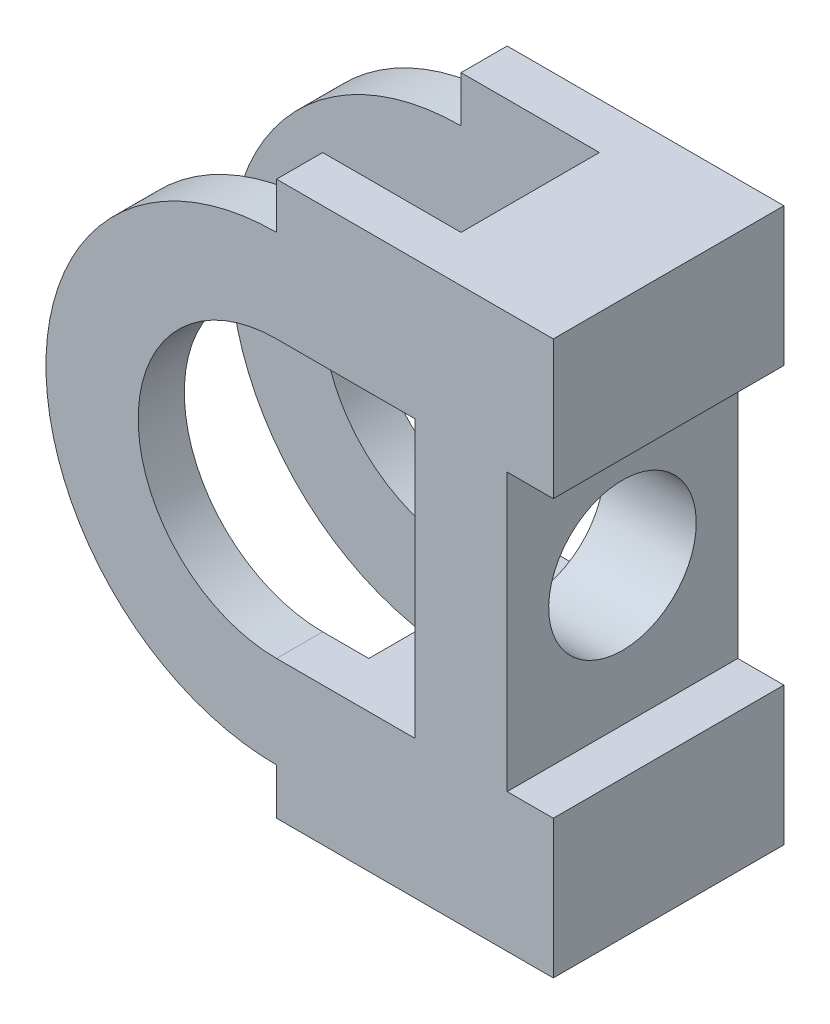
ISO-10303-21;
HEADER;
FILE_DESCRIPTION(('STEP AP214'),'2;1');
FILE_NAME('part.step','',(''),(''),'','','');
FILE_SCHEMA(('AUTOMOTIVE_DESIGN { 1 0 10303 214 1 1 1 1 }'));
ENDSEC;
DATA;
#1=APPLICATION_CONTEXT('core data for automotive mechanical design processes');
#2=APPLICATION_PROTOCOL_DEFINITION('international standard','automotive_design',2000,#1);
#3=PRODUCT_CONTEXT('',#1,'mechanical');
#4=PRODUCT('Part','Part','',(#3));
#5=PRODUCT_RELATED_PRODUCT_CATEGORY('part','',(#4));
#6=PRODUCT_DEFINITION_FORMATION('','',#4);
#7=PRODUCT_DEFINITION_CONTEXT('part definition',#1,'design');
#8=PRODUCT_DEFINITION('design','',#6,#7);
#9=PRODUCT_DEFINITION_SHAPE('','',#8);
#10=(LENGTH_UNIT() NAMED_UNIT(*) SI_UNIT(.MILLI.,.METRE.));
#11=(NAMED_UNIT(*) PLANE_ANGLE_UNIT() SI_UNIT($,.RADIAN.));
#12=(NAMED_UNIT(*) SI_UNIT($,.STERADIAN.) SOLID_ANGLE_UNIT());
#13=UNCERTAINTY_MEASURE_WITH_UNIT(LENGTH_MEASURE(1.E-05),#10,'distance_accuracy_value','');
#14=(GEOMETRIC_REPRESENTATION_CONTEXT(3) GLOBAL_UNCERTAINTY_ASSIGNED_CONTEXT((#13)) GLOBAL_UNIT_ASSIGNED_CONTEXT((#10,
#11,#12)) REPRESENTATION_CONTEXT('',''));
#15=CARTESIAN_POINT('',(0.,0.,0.));
#16=DIRECTION('',(0.,0.,1.));
#17=DIRECTION('',(1.,0.,0.));
#18=AXIS2_PLACEMENT_3D('',#15,#16,#17);
#19=CARTESIAN_POINT('',(9.99999999999999,-57.,10.));
#20=DIRECTION('',(1.,0.,0.));
#21=DIRECTION('',(0.,0.,-1.));
#22=AXIS2_PLACEMENT_3D('',#19,#20,#21);
#23=PLANE('',#22);
#24=DIRECTION('',(0.,0.,1.));
#25=VECTOR('',#24,1.);
#26=CARTESIAN_POINT('',(9.99999999999999,100.,10.));
#27=LINE('',#26,#25);
#28=CARTESIAN_POINT('',(9.99999999999999,100.,10.));
#29=VERTEX_POINT('',#28);
#30=CARTESIAN_POINT('',(10.,100.,40.));
#31=VERTEX_POINT('',#30);
#32=EDGE_CURVE('E247',#29,#31,#27,.T.);
#33=ORIENTED_EDGE('',*,*,#32,.F.);
#34=DIRECTION('',(0.,1.,0.));
#35=VECTOR('',#34,1.);
#36=CARTESIAN_POINT('',(9.99999999999999,-57.,10.));
#37=LINE('',#36,#35);
#38=CARTESIAN_POINT('',(9.99999999999999,90.,10.));
#39=VERTEX_POINT('',#38);
#40=EDGE_CURVE('E276',#39,#29,#37,.T.);
#41=ORIENTED_EDGE('',*,*,#40,.F.);
#42=DIRECTION('',(0.,0.,-1.));
#43=VECTOR('',#42,1.);
#44=CARTESIAN_POINT('',(9.99999999999999,90.,0.));
#45=LINE('',#44,#43);
#46=CARTESIAN_POINT('',(10.,90.,40.));
#47=VERTEX_POINT('',#46);
#48=EDGE_CURVE('E313',#47,#39,#45,.T.);
#49=ORIENTED_EDGE('',*,*,#48,.F.);
#50=DIRECTION('',(0.,1.,0.));
#51=VECTOR('',#50,1.);
#52=CARTESIAN_POINT('',(10.,-57.,40.));
#53=LINE('',#52,#51);
#54=EDGE_CURVE('E277',#47,#31,#53,.T.);
#55=ORIENTED_EDGE('',*,*,#54,.T.);
#56=EDGE_LOOP('',(#33,#41,#49,#55));
#57=FACE_BOUND('',#56,.T.);
#58=ADVANCED_FACE('F35',(#57),#23,.F.);
#59=CARTESIAN_POINT('',(0.,0.,50.));
#60=DIRECTION('',(1.,0.,0.));
#61=DIRECTION('',(0.,0.,-1.));
#62=AXIS2_PLACEMENT_3D('',#59,#60,#61);
#63=PLANE('',#62);
#64=DIRECTION('',(0.,0.,-1.));
#65=VECTOR('',#64,1.);
#66=CARTESIAN_POINT('',(0.,9.99999999999999,50.));
#67=LINE('',#66,#65);
#68=CARTESIAN_POINT('',(0.,9.99999999999999,50.));
#69=VERTEX_POINT('',#68);
#70=CARTESIAN_POINT('',(0.,9.99999999999999,40.));
#71=VERTEX_POINT('',#70);
#72=EDGE_CURVE('E412',#69,#71,#67,.T.);
#73=ORIENTED_EDGE('',*,*,#72,.T.);
#74=DIRECTION('',(0.,-1.,0.));
#75=VECTOR('',#74,1.);
#76=CARTESIAN_POINT('',(0.,0.,40.));
#77=LINE('',#76,#75);
#78=CARTESIAN_POINT('',(0.,0.,40.));
#79=VERTEX_POINT('',#78);
#80=EDGE_CURVE('E308',#71,#79,#77,.T.);
#81=ORIENTED_EDGE('',*,*,#80,.T.);
#82=DIRECTION('',(0.,0.,-1.));
#83=VECTOR('',#82,1.);
#84=CARTESIAN_POINT('',(0.,0.,50.));
#85=LINE('',#84,#83);
#86=CARTESIAN_POINT('',(0.,0.,50.));
#87=VERTEX_POINT('',#86);
#88=EDGE_CURVE('E430',#87,#79,#85,.T.);
#89=ORIENTED_EDGE('',*,*,#88,.F.);
#90=DIRECTION('',(0.,-1.,0.));
#91=VECTOR('',#90,1.);
#92=CARTESIAN_POINT('',(0.,0.,50.));
#93=LINE('',#92,#91);
#94=EDGE_CURVE('E379',#69,#87,#93,.T.);
#95=ORIENTED_EDGE('',*,*,#94,.F.);
#96=EDGE_LOOP('',(#73,#81,#89,#95));
#97=FACE_BOUND('',#96,.T.);
#98=ADVANCED_FACE('F509',(#97),#63,.F.);
#99=CARTESIAN_POINT('',(3.46944695195361E-13,120.,50.));
#100=DIRECTION('',(1.,0.,0.));
#101=DIRECTION('',(0.,0.,-1.));
#102=AXIS2_PLACEMENT_3D('',#99,#100,#101);
#103=PLANE('',#102);
#104=DIRECTION('',(0.,0.,-1.));
#105=VECTOR('',#104,1.);
#106=CARTESIAN_POINT('',(3.46944695195361E-13,120.,50.));
#107=LINE('',#106,#105);
#108=CARTESIAN_POINT('',(3.46944695195361E-13,120.,50.));
#109=VERTEX_POINT('',#108);
#110=CARTESIAN_POINT('',(3.46944695195361E-13,120.,40.));
#111=VERTEX_POINT('',#110);
#112=EDGE_CURVE('E420',#109,#111,#107,.T.);
#113=ORIENTED_EDGE('',*,*,#112,.T.);
#114=DIRECTION('',(0.,-1.,0.));
#115=VECTOR('',#114,1.);
#116=CARTESIAN_POINT('',(3.46944695195361E-13,120.,40.));
#117=LINE('',#116,#115);
#118=CARTESIAN_POINT('',(3.46944695195361E-13,110.,40.));
#119=VERTEX_POINT('',#118);
#120=EDGE_CURVE('E305',#111,#119,#117,.T.);
#121=ORIENTED_EDGE('',*,*,#120,.T.);
#122=DIRECTION('',(0.,0.,-1.));
#123=VECTOR('',#122,1.);
#124=CARTESIAN_POINT('',(3.46944695195361E-13,110.,50.));
#125=LINE('',#124,#123);
#126=CARTESIAN_POINT('',(3.46944695195361E-13,110.,50.));
#127=VERTEX_POINT('',#126);
#128=EDGE_CURVE('E416',#127,#119,#125,.T.);
#129=ORIENTED_EDGE('',*,*,#128,.F.);
#130=DIRECTION('',(0.,-1.,0.));
#131=VECTOR('',#130,1.);
#132=CARTESIAN_POINT('',(3.46944695195361E-13,120.,50.));
#133=LINE('',#132,#131);
#134=EDGE_CURVE('E391',#109,#127,#133,.T.);
#135=ORIENTED_EDGE('',*,*,#134,.F.);
#136=EDGE_LOOP('',(#113,#121,#129,#135));
#137=FACE_BOUND('',#136,.T.);
#138=ADVANCED_FACE('F514',(#137),#103,.F.);
#139=CARTESIAN_POINT('',(3.4670667125539E-13,60.,50.));
#140=DIRECTION('',(0.,0.,-1.));
#141=DIRECTION('',(-1.,0.,0.));
#142=AXIS2_PLACEMENT_3D('',#139,#140,#141);
#143=CYLINDRICAL_SURFACE('',#142,50.);
#144=ORIENTED_EDGE('',*,*,#128,.T.);
#145=CARTESIAN_POINT('',(3.4670667125539E-13,60.,40.));
#146=DIRECTION('',(0.,0.,1.));
#147=DIRECTION('',(1.,0.,0.));
#148=AXIS2_PLACEMENT_3D('',#145,#146,#147);
#149=CIRCLE('',#148,50.);
#150=EDGE_CURVE('E303',#119,#71,#149,.T.);
#151=ORIENTED_EDGE('',*,*,#150,.T.);
#152=ORIENTED_EDGE('',*,*,#72,.F.);
#153=CARTESIAN_POINT('',(3.4670667125539E-13,60.,50.));
#154=DIRECTION('',(0.,0.,1.));
#155=DIRECTION('',(1.,0.,0.));
#156=AXIS2_PLACEMENT_3D('',#153,#154,#155);
#157=CIRCLE('',#156,50.);
#158=EDGE_CURVE('E393',#127,#69,#157,.T.);
#159=ORIENTED_EDGE('',*,*,#158,.F.);
#160=EDGE_LOOP('',(#144,#151,#152,#159));
#161=FACE_BOUND('',#160,.T.);
#162=ADVANCED_FACE('F517',(#161),#143,.T.);
#163=CARTESIAN_POINT('',(3.4670667125539E-13,60.,0.));
#164=DIRECTION('',(0.,0.,1.));
#165=DIRECTION('',(1.,0.,0.));
#166=AXIS2_PLACEMENT_3D('',#163,#164,#165);
#167=CYLINDRICAL_SURFACE('',#166,30.);
#168=DIRECTION('',(0.,0.,1.));
#169=VECTOR('',#168,1.);
#170=CARTESIAN_POINT('',(3.46685487749915E-13,30.,0.));
#171=LINE('',#170,#169);
#172=CARTESIAN_POINT('',(3.46685487749915E-13,30.,40.));
#173=VERTEX_POINT('',#172);
#174=CARTESIAN_POINT('',(3.46685487749915E-13,30.,50.));
#175=VERTEX_POINT('',#174);
#176=EDGE_CURVE('E349',#173,#175,#171,.T.);
#177=ORIENTED_EDGE('',*,*,#176,.F.);
#178=CARTESIAN_POINT('',(3.4670667125539E-13,60.,40.));
#179=DIRECTION('',(0.,0.,1.));
#180=DIRECTION('',(1.,0.,0.));
#181=AXIS2_PLACEMENT_3D('',#178,#179,#180);
#182=CIRCLE('',#181,30.);
#183=CARTESIAN_POINT('',(3.48543641454111E-13,90.,40.));
#184=VERTEX_POINT('',#183);
#185=EDGE_CURVE('E43',#173,#184,#182,.F.);
#186=ORIENTED_EDGE('',*,*,#185,.T.);
#187=DIRECTION('',(0.,0.,1.));
#188=VECTOR('',#187,1.);
#189=CARTESIAN_POINT('',(3.48543641454111E-13,90.,0.));
#190=LINE('',#189,#188);
#191=CARTESIAN_POINT('',(3.48543641454111E-13,90.,50.));
#192=VERTEX_POINT('',#191);
#193=EDGE_CURVE('E330',#184,#192,#190,.T.);
#194=ORIENTED_EDGE('',*,*,#193,.T.);
#195=CARTESIAN_POINT('',(3.4670667125539E-13,60.,50.));
#196=DIRECTION('',(0.,0.,1.));
#197=DIRECTION('',(1.,0.,0.));
#198=AXIS2_PLACEMENT_3D('',#195,#196,#197);
#199=CIRCLE('',#198,30.);
#200=EDGE_CURVE('E333',#192,#175,#199,.T.);
#201=ORIENTED_EDGE('',*,*,#200,.T.);
#202=EDGE_LOOP('',(#177,#186,#194,#201));
#203=FACE_BOUND('',#202,.T.);
#204=ADVANCED_FACE('F438',(#203),#167,.F.);
#205=CARTESIAN_POINT('',(60.,0.,50.));
#206=DIRECTION('',(-1.,0.,0.));
#207=DIRECTION('',(0.,0.,1.));
#208=AXIS2_PLACEMENT_3D('',#205,#206,#207);
#209=PLANE('',#208);
#210=DIRECTION('',(0.,1.,0.));
#211=VECTOR('',#210,1.);
#212=CARTESIAN_POINT('',(60.,0.,0.));
#213=LINE('',#212,#211);
#214=CARTESIAN_POINT('',(60.,0.,0.));
#215=VERTEX_POINT('',#214);
#216=CARTESIAN_POINT('',(60.,30.,0.));
#217=VERTEX_POINT('',#216);
#218=EDGE_CURVE('E401',#215,#217,#213,.T.);
#219=ORIENTED_EDGE('',*,*,#218,.T.);
#220=DIRECTION('',(0.,0.,1.));
#221=VECTOR('',#220,1.);
#222=CARTESIAN_POINT('',(60.,30.,0.));
#223=LINE('',#222,#221);
#224=CARTESIAN_POINT('',(60.,30.,50.));
#225=VERTEX_POINT('',#224);
#226=EDGE_CURVE('E370',#217,#225,#223,.T.);
#227=ORIENTED_EDGE('',*,*,#226,.T.);
#228=DIRECTION('',(0.,1.,0.));
#229=VECTOR('',#228,1.);
#230=CARTESIAN_POINT('',(60.,0.,50.));
#231=LINE('',#230,#229);
#232=CARTESIAN_POINT('',(60.,0.,50.));
#233=VERTEX_POINT('',#232);
#234=EDGE_CURVE('E386',#233,#225,#231,.T.);
#235=ORIENTED_EDGE('',*,*,#234,.F.);
#236=DIRECTION('',(0.,0.,-1.));
#237=VECTOR('',#236,1.);
#238=CARTESIAN_POINT('',(60.,0.,50.));
#239=LINE('',#238,#237);
#240=EDGE_CURVE('E426',#233,#215,#239,.T.);
#241=ORIENTED_EDGE('',*,*,#240,.T.);
#242=EDGE_LOOP('',(#219,#227,#235,#241));
#243=FACE_BOUND('',#242,.T.);
#244=ADVANCED_FACE('F503',(#243),#209,.F.);
#245=CARTESIAN_POINT('',(0.,0.,10.));
#246=VERTEX_POINT('',#245);
#247=CARTESIAN_POINT('',(0.,0.,0.));
#248=VERTEX_POINT('',#247);
#249=EDGE_CURVE('E429',#246,#248,#85,.T.);
#250=ORIENTED_EDGE('',*,*,#249,.F.);
#251=DIRECTION('',(0.,1.,0.));
#252=VECTOR('',#251,1.);
#253=CARTESIAN_POINT('',(0.,0.,10.));
#254=LINE('',#253,#252);
#255=CARTESIAN_POINT('',(0.,9.99999999999999,10.));
#256=VERTEX_POINT('',#255);
#257=EDGE_CURVE('E293',#246,#256,#254,.T.);
#258=ORIENTED_EDGE('',*,*,#257,.T.);
#259=CARTESIAN_POINT('',(0.,9.99999999999999,0.));
#260=VERTEX_POINT('',#259);
#261=EDGE_CURVE('E395',#256,#260,#67,.T.);
#262=ORIENTED_EDGE('',*,*,#261,.T.);
#263=DIRECTION('',(0.,-1.,0.));
#264=VECTOR('',#263,1.);
#265=CARTESIAN_POINT('',(0.,0.,0.));
#266=LINE('',#265,#264);
#267=EDGE_CURVE('E373',#260,#248,#266,.T.);
#268=ORIENTED_EDGE('',*,*,#267,.T.);
#269=EDGE_LOOP('',(#250,#258,#262,#268));
#270=FACE_BOUND('',#269,.T.);
#271=ADVANCED_FACE('F37',(#270),#63,.F.);
#272=CARTESIAN_POINT('',(0.,0.,50.));
#273=DIRECTION('',(0.,1.,0.));
#274=DIRECTION('',(0.,0.,1.));
#275=AXIS2_PLACEMENT_3D('',#272,#273,#274);
#276=PLANE('',#275);
#277=DIRECTION('',(1.,0.,0.));
#278=VECTOR('',#277,1.);
#279=CARTESIAN_POINT('',(0.,0.,40.));
#280=LINE('',#279,#278);
#281=CARTESIAN_POINT('',(30.,0.,40.));
#282=VERTEX_POINT('',#281);
#283=EDGE_CURVE('E311',#79,#282,#280,.T.);
#284=ORIENTED_EDGE('',*,*,#283,.T.);
#285=DIRECTION('',(0.,0.,1.));
#286=VECTOR('',#285,1.);
#287=CARTESIAN_POINT('',(30.,0.,10.));
#288=LINE('',#287,#286);
#289=CARTESIAN_POINT('',(30.,0.,10.));
#290=VERTEX_POINT('',#289);
#291=EDGE_CURVE('E240',#290,#282,#288,.T.);
#292=ORIENTED_EDGE('',*,*,#291,.F.);
#293=DIRECTION('',(-1.,0.,0.));
#294=VECTOR('',#293,1.);
#295=CARTESIAN_POINT('',(0.,0.,10.));
#296=LINE('',#295,#294);
#297=EDGE_CURVE('E225',#290,#246,#296,.T.);
#298=ORIENTED_EDGE('',*,*,#297,.T.);
#299=ORIENTED_EDGE('',*,*,#249,.T.);
#300=DIRECTION('',(1.,0.,0.));
#301=VECTOR('',#300,1.);
#302=CARTESIAN_POINT('',(0.,0.,0.));
#303=LINE('',#302,#301);
#304=EDGE_CURVE('E398',#248,#215,#303,.T.);
#305=ORIENTED_EDGE('',*,*,#304,.T.);
#306=ORIENTED_EDGE('',*,*,#240,.F.);
#307=DIRECTION('',(1.,0.,0.));
#308=VECTOR('',#307,1.);
#309=CARTESIAN_POINT('',(0.,0.,50.));
#310=LINE('',#309,#308);
#311=EDGE_CURVE('E382',#87,#233,#310,.T.);
#312=ORIENTED_EDGE('',*,*,#311,.F.);
#313=ORIENTED_EDGE('',*,*,#88,.T.);
#314=EDGE_LOOP('',(#284,#292,#298,#299,#305,#306,#312,#313));
#315=FACE_BOUND('',#314,.T.);
#316=ADVANCED_FACE('F500',(#315),#276,.F.);
#317=CARTESIAN_POINT('',(60.,90.,50.));
#318=VERTEX_POINT('',#317);
#319=CARTESIAN_POINT('',(60.,120.,50.));
#320=VERTEX_POINT('',#319);
#321=EDGE_CURVE('E385',#318,#320,#231,.T.);
#322=ORIENTED_EDGE('',*,*,#321,.F.);
#323=DIRECTION('',(0.,0.,1.));
#324=VECTOR('',#323,1.);
#325=CARTESIAN_POINT('',(60.,90.,0.));
#326=LINE('',#325,#324);
#327=CARTESIAN_POINT('',(60.,90.,0.));
#328=VERTEX_POINT('',#327);
#329=EDGE_CURVE('E363',#328,#318,#326,.T.);
#330=ORIENTED_EDGE('',*,*,#329,.F.);
#331=CARTESIAN_POINT('',(60.,120.,0.));
#332=VERTEX_POINT('',#331);
#333=EDGE_CURVE('E400',#328,#332,#213,.T.);
#334=ORIENTED_EDGE('',*,*,#333,.T.);
#335=DIRECTION('',(0.,0.,-1.));
#336=VECTOR('',#335,1.);
#337=CARTESIAN_POINT('',(60.,120.,50.));
#338=LINE('',#337,#336);
#339=EDGE_CURVE('E423',#320,#332,#338,.T.);
#340=ORIENTED_EDGE('',*,*,#339,.F.);
#341=EDGE_LOOP('',(#322,#330,#334,#340));
#342=FACE_BOUND('',#341,.T.);
#343=ADVANCED_FACE('F525',(#342),#209,.F.);
#344=CARTESIAN_POINT('',(3.46944695195361E-13,120.,50.));
#345=DIRECTION('',(0.,-1.,0.));
#346=DIRECTION('',(0.,0.,-1.));
#347=AXIS2_PLACEMENT_3D('',#344,#345,#346);
#348=PLANE('',#347);
#349=DIRECTION('',(-1.,0.,0.));
#350=VECTOR('',#349,1.);
#351=CARTESIAN_POINT('',(9.99999999999999,120.,10.));
#352=LINE('',#351,#350);
#353=CARTESIAN_POINT('',(30.,120.,10.));
#354=VERTEX_POINT('',#353);
#355=CARTESIAN_POINT('',(3.50414142147315E-13,120.,10.));
#356=VERTEX_POINT('',#355);
#357=EDGE_CURVE('E272',#354,#356,#352,.T.);
#358=ORIENTED_EDGE('',*,*,#357,.F.);
#359=DIRECTION('',(0.,0.,-1.));
#360=VECTOR('',#359,1.);
#361=CARTESIAN_POINT('',(30.,120.,10.));
#362=LINE('',#361,#360);
#363=CARTESIAN_POINT('',(30.,120.,40.));
#364=VERTEX_POINT('',#363);
#365=EDGE_CURVE('E245',#364,#354,#362,.T.);
#366=ORIENTED_EDGE('',*,*,#365,.F.);
#367=DIRECTION('',(1.,0.,0.));
#368=VECTOR('',#367,1.);
#369=CARTESIAN_POINT('',(10.,120.,40.));
#370=LINE('',#369,#368);
#371=EDGE_CURVE('E274',#111,#364,#370,.T.);
#372=ORIENTED_EDGE('',*,*,#371,.F.);
#373=ORIENTED_EDGE('',*,*,#112,.F.);
#374=DIRECTION('',(-1.,0.,0.));
#375=VECTOR('',#374,1.);
#376=CARTESIAN_POINT('',(3.46944695195361E-13,120.,50.));
#377=LINE('',#376,#375);
#378=EDGE_CURVE('E389',#320,#109,#377,.T.);
#379=ORIENTED_EDGE('',*,*,#378,.F.);
#380=ORIENTED_EDGE('',*,*,#339,.T.);
#381=DIRECTION('',(-1.,0.,0.));
#382=VECTOR('',#381,1.);
#383=CARTESIAN_POINT('',(3.46944695195361E-13,120.,0.));
#384=LINE('',#383,#382);
#385=CARTESIAN_POINT('',(3.46944695195361E-13,120.,0.));
#386=VERTEX_POINT('',#385);
#387=EDGE_CURVE('E404',#332,#386,#384,.T.);
#388=ORIENTED_EDGE('',*,*,#387,.T.);
#389=EDGE_CURVE('E419',#356,#386,#107,.T.);
#390=ORIENTED_EDGE('',*,*,#389,.F.);
#391=EDGE_LOOP('',(#358,#366,#372,#373,#379,#380,#388,#390));
#392=FACE_BOUND('',#391,.T.);
#393=ADVANCED_FACE('F481',(#392),#348,.F.);
#394=CARTESIAN_POINT('',(3.46944695195361E-13,110.,10.));
#395=VERTEX_POINT('',#394);
#396=CARTESIAN_POINT('',(3.46944695195361E-13,110.,0.));
#397=VERTEX_POINT('',#396);
#398=EDGE_CURVE('E415',#395,#397,#125,.T.);
#399=ORIENTED_EDGE('',*,*,#398,.F.);
#400=DIRECTION('',(0.,1.,0.));
#401=VECTOR('',#400,1.);
#402=CARTESIAN_POINT('',(3.46944695195361E-13,120.,10.));
#403=LINE('',#402,#401);
#404=EDGE_CURVE('E290',#395,#356,#403,.T.);
#405=ORIENTED_EDGE('',*,*,#404,.T.);
#406=ORIENTED_EDGE('',*,*,#389,.T.);
#407=DIRECTION('',(0.,-1.,0.));
#408=VECTOR('',#407,1.);
#409=CARTESIAN_POINT('',(3.46944695195361E-13,120.,0.));
#410=LINE('',#409,#408);
#411=EDGE_CURVE('E407',#386,#397,#410,.T.);
#412=ORIENTED_EDGE('',*,*,#411,.T.);
#413=EDGE_LOOP('',(#399,#405,#406,#412));
#414=FACE_BOUND('',#413,.T.);
#415=ADVANCED_FACE('F488',(#414),#103,.F.);
#416=CARTESIAN_POINT('',(3.4670667125539E-13,60.,10.));
#417=DIRECTION('',(0.,0.,-1.));
#418=DIRECTION('',(-1.,0.,0.));
#419=AXIS2_PLACEMENT_3D('',#416,#417,#418);
#420=CIRCLE('',#419,50.);
#421=EDGE_CURVE('E288',#256,#395,#420,.T.);
#422=ORIENTED_EDGE('',*,*,#421,.T.);
#423=ORIENTED_EDGE('',*,*,#398,.T.);
#424=CARTESIAN_POINT('',(3.4670667125539E-13,60.,0.));
#425=DIRECTION('',(0.,0.,1.));
#426=DIRECTION('',(1.,0.,0.));
#427=AXIS2_PLACEMENT_3D('',#424,#425,#426);
#428=CIRCLE('',#427,50.);
#429=EDGE_CURVE('E383',#397,#260,#428,.T.);
#430=ORIENTED_EDGE('',*,*,#429,.T.);
#431=ORIENTED_EDGE('',*,*,#261,.F.);
#432=EDGE_LOOP('',(#422,#423,#430,#431));
#433=FACE_BOUND('',#432,.T.);
#434=ADVANCED_FACE('F494',(#433),#143,.T.);
#435=CARTESIAN_POINT('',(3.4670667125539E-13,60.,50.));
#436=DIRECTION('',(0.,0.,1.));
#437=DIRECTION('',(1.,0.,0.));
#438=AXIS2_PLACEMENT_3D('',#435,#436,#437);
#439=PLANE('',#438);
#440=DIRECTION('',(-1.,0.,0.));
#441=VECTOR('',#440,1.);
#442=CARTESIAN_POINT('',(3.46727854760864E-13,90.,50.));
#443=LINE('',#442,#441);
#444=CARTESIAN_POINT('',(30.,90.,50.));
#445=VERTEX_POINT('',#444);
#446=EDGE_CURVE('E316',#445,#192,#443,.T.);
#447=ORIENTED_EDGE('',*,*,#446,.F.);
#448=DIRECTION('',(0.,1.,0.));
#449=VECTOR('',#448,1.);
#450=CARTESIAN_POINT('',(30.,90.,50.));
#451=LINE('',#450,#449);
#452=CARTESIAN_POINT('',(30.,30.,50.));
#453=VERTEX_POINT('',#452);
#454=EDGE_CURVE('E321',#453,#445,#451,.T.);
#455=ORIENTED_EDGE('',*,*,#454,.F.);
#456=DIRECTION('',(1.,0.,0.));
#457=VECTOR('',#456,1.);
#458=CARTESIAN_POINT('',(3.46685487749915E-13,30.,50.));
#459=LINE('',#458,#457);
#460=EDGE_CURVE('E336',#175,#453,#459,.T.);
#461=ORIENTED_EDGE('',*,*,#460,.F.);
#462=ORIENTED_EDGE('',*,*,#200,.F.);
#463=EDGE_LOOP('',(#447,#455,#461,#462));
#464=FACE_BOUND('',#463,.T.);
#465=DIRECTION('',(1.,0.,0.));
#466=VECTOR('',#465,1.);
#467=CARTESIAN_POINT('',(60.,30.,50.));
#468=LINE('',#467,#466);
#469=CARTESIAN_POINT('',(50.,30.,50.));
#470=VERTEX_POINT('',#469);
#471=EDGE_CURVE('E357',#470,#225,#468,.T.);
#472=ORIENTED_EDGE('',*,*,#471,.F.);
#473=DIRECTION('',(0.,-1.,0.));
#474=VECTOR('',#473,1.);
#475=CARTESIAN_POINT('',(50.,90.,50.));
#476=LINE('',#475,#474);
#477=CARTESIAN_POINT('',(50.,90.,50.));
#478=VERTEX_POINT('',#477);
#479=EDGE_CURVE('E366',#478,#470,#476,.T.);
#480=ORIENTED_EDGE('',*,*,#479,.F.);
#481=DIRECTION('',(-1.,0.,0.));
#482=VECTOR('',#481,1.);
#483=CARTESIAN_POINT('',(60.,90.,50.));
#484=LINE('',#483,#482);
#485=EDGE_CURVE('E343',#318,#478,#484,.T.);
#486=ORIENTED_EDGE('',*,*,#485,.F.);
#487=ORIENTED_EDGE('',*,*,#321,.T.);
#488=ORIENTED_EDGE('',*,*,#378,.T.);
#489=ORIENTED_EDGE('',*,*,#134,.T.);
#490=ORIENTED_EDGE('',*,*,#158,.T.);
#491=ORIENTED_EDGE('',*,*,#94,.T.);
#492=ORIENTED_EDGE('',*,*,#311,.T.);
#493=ORIENTED_EDGE('',*,*,#234,.T.);
#494=EDGE_LOOP('',(#472,#480,#486,#487,#488,#489,#490,#491,#492,#493));
#495=FACE_BOUND('',#494,.T.);
#496=ADVANCED_FACE('F449',(#464,#495),#439,.T.);
#497=CARTESIAN_POINT('',(3.4670667125539E-13,60.,0.));
#498=DIRECTION('',(0.,0.,1.));
#499=DIRECTION('',(1.,0.,0.));
#500=AXIS2_PLACEMENT_3D('',#497,#498,#499);
#501=PLANE('',#500);
#502=DIRECTION('',(0.,1.,0.));
#503=VECTOR('',#502,1.);
#504=CARTESIAN_POINT('',(30.,90.,0.));
#505=LINE('',#504,#503);
#506=CARTESIAN_POINT('',(30.,30.,0.));
#507=VERTEX_POINT('',#506);
#508=CARTESIAN_POINT('',(30.,90.,0.));
#509=VERTEX_POINT('',#508);
#510=EDGE_CURVE('E327',#507,#509,#505,.T.);
#511=ORIENTED_EDGE('',*,*,#510,.T.);
#512=DIRECTION('',(-1.,0.,0.));
#513=VECTOR('',#512,1.);
#514=CARTESIAN_POINT('',(3.46727854760864E-13,90.,0.));
#515=LINE('',#514,#513);
#516=CARTESIAN_POINT('',(3.48543641454111E-13,90.,0.));
#517=VERTEX_POINT('',#516);
#518=EDGE_CURVE('E317',#509,#517,#515,.T.);
#519=ORIENTED_EDGE('',*,*,#518,.T.);
#520=CARTESIAN_POINT('',(3.4670667125539E-13,60.,0.));
#521=DIRECTION('',(0.,0.,1.));
#522=DIRECTION('',(1.,0.,0.));
#523=AXIS2_PLACEMENT_3D('',#520,#521,#522);
#524=CIRCLE('',#523,30.);
#525=CARTESIAN_POINT('',(3.46685487749915E-13,30.,0.));
#526=VERTEX_POINT('',#525);
#527=EDGE_CURVE('E320',#517,#526,#524,.T.);
#528=ORIENTED_EDGE('',*,*,#527,.T.);
#529=DIRECTION('',(1.,0.,0.));
#530=VECTOR('',#529,1.);
#531=CARTESIAN_POINT('',(3.46685487749915E-13,30.,0.));
#532=LINE('',#531,#530);
#533=EDGE_CURVE('E324',#526,#507,#532,.T.);
#534=ORIENTED_EDGE('',*,*,#533,.T.);
#535=EDGE_LOOP('',(#511,#519,#528,#534));
#536=FACE_BOUND('',#535,.T.);
#537=DIRECTION('',(0.,-1.,0.));
#538=VECTOR('',#537,1.);
#539=CARTESIAN_POINT('',(50.,90.,0.));
#540=LINE('',#539,#538);
#541=CARTESIAN_POINT('',(50.,90.,0.));
#542=VERTEX_POINT('',#541);
#543=CARTESIAN_POINT('',(50.,30.,0.));
#544=VERTEX_POINT('',#543);
#545=EDGE_CURVE('E356',#542,#544,#540,.T.);
#546=ORIENTED_EDGE('',*,*,#545,.T.);
#547=DIRECTION('',(1.,0.,0.));
#548=VECTOR('',#547,1.);
#549=CARTESIAN_POINT('',(60.,30.,0.));
#550=LINE('',#549,#548);
#551=EDGE_CURVE('E360',#544,#217,#550,.T.);
#552=ORIENTED_EDGE('',*,*,#551,.T.);
#553=ORIENTED_EDGE('',*,*,#218,.F.);
#554=ORIENTED_EDGE('',*,*,#304,.F.);
#555=ORIENTED_EDGE('',*,*,#267,.F.);
#556=ORIENTED_EDGE('',*,*,#429,.F.);
#557=ORIENTED_EDGE('',*,*,#411,.F.);
#558=ORIENTED_EDGE('',*,*,#387,.F.);
#559=ORIENTED_EDGE('',*,*,#333,.F.);
#560=DIRECTION('',(-1.,0.,0.));
#561=VECTOR('',#560,1.);
#562=CARTESIAN_POINT('',(60.,90.,0.));
#563=LINE('',#562,#561);
#564=EDGE_CURVE('E353',#328,#542,#563,.T.);
#565=ORIENTED_EDGE('',*,*,#564,.T.);
#566=EDGE_LOOP('',(#546,#552,#553,#554,#555,#556,#557,#558,#559,#565));
#567=FACE_BOUND('',#566,.T.);
#568=ADVANCED_FACE('F465',(#536,#567),#501,.F.);
#569=CARTESIAN_POINT('',(60.,30.,0.));
#570=DIRECTION('',(0.,-1.,0.));
#571=DIRECTION('',(0.,0.,-1.));
#572=AXIS2_PLACEMENT_3D('',#569,#570,#571);
#573=PLANE('',#572);
#574=ORIENTED_EDGE('',*,*,#471,.T.);
#575=ORIENTED_EDGE('',*,*,#226,.F.);
#576=ORIENTED_EDGE('',*,*,#551,.F.);
#577=DIRECTION('',(0.,0.,1.));
#578=VECTOR('',#577,1.);
#579=CARTESIAN_POINT('',(50.,30.,0.));
#580=LINE('',#579,#578);
#581=EDGE_CURVE('E374',#544,#470,#580,.T.);
#582=ORIENTED_EDGE('',*,*,#581,.T.);
#583=EDGE_LOOP('',(#574,#575,#576,#582));
#584=FACE_BOUND('',#583,.T.);
#585=ADVANCED_FACE('F533',(#584),#573,.F.);
#586=CARTESIAN_POINT('',(50.,90.,0.));
#587=DIRECTION('',(-1.,0.,0.));
#588=DIRECTION('',(0.,-1.,0.));
#589=AXIS2_PLACEMENT_3D('',#586,#587,#588);
#590=PLANE('',#589);
#591=CARTESIAN_POINT('',(50.,60.,25.));
#592=DIRECTION('',(-1.,0.,0.));
#593=DIRECTION('',(0.,-1.,0.));
#594=AXIS2_PLACEMENT_3D('',#591,#592,#593);
#595=CIRCLE('',#594,16.);
#596=CARTESIAN_POINT('',(50.,44.,25.));
#597=VERTEX_POINT('',#596);
#598=EDGE_CURVE('E269',#597,#597,#595,.T.);
#599=ORIENTED_EDGE('',*,*,#598,.T.);
#600=EDGE_LOOP('',(#599));
#601=FACE_BOUND('',#600,.T.);
#602=ORIENTED_EDGE('',*,*,#479,.T.);
#603=ORIENTED_EDGE('',*,*,#581,.F.);
#604=ORIENTED_EDGE('',*,*,#545,.F.);
#605=DIRECTION('',(0.,0.,1.));
#606=VECTOR('',#605,1.);
#607=CARTESIAN_POINT('',(50.,90.,0.));
#608=LINE('',#607,#606);
#609=EDGE_CURVE('E376',#542,#478,#608,.T.);
#610=ORIENTED_EDGE('',*,*,#609,.T.);
#611=EDGE_LOOP('',(#602,#603,#604,#610));
#612=FACE_BOUND('',#611,.T.);
#613=ADVANCED_FACE('F530',(#601,#612),#590,.F.);
#614=CARTESIAN_POINT('',(60.,90.,0.));
#615=DIRECTION('',(0.,1.,0.));
#616=DIRECTION('',(-1.,0.,0.));
#617=AXIS2_PLACEMENT_3D('',#614,#615,#616);
#618=PLANE('',#617);
#619=ORIENTED_EDGE('',*,*,#485,.T.);
#620=ORIENTED_EDGE('',*,*,#609,.F.);
#621=ORIENTED_EDGE('',*,*,#564,.F.);
#622=ORIENTED_EDGE('',*,*,#329,.T.);
#623=EDGE_LOOP('',(#619,#620,#621,#622));
#624=FACE_BOUND('',#623,.T.);
#625=ADVANCED_FACE('F527',(#624),#618,.F.);
#626=CARTESIAN_POINT('',(3.46727854760864E-13,90.,0.));
#627=DIRECTION('',(0.,1.,0.));
#628=DIRECTION('',(0.,0.,1.));
#629=AXIS2_PLACEMENT_3D('',#626,#627,#628);
#630=PLANE('',#629);
#631=ORIENTED_EDGE('',*,*,#193,.F.);
#632=DIRECTION('',(1.,0.,0.));
#633=VECTOR('',#632,1.);
#634=CARTESIAN_POINT('',(3.51353784030136E-13,90.,40.));
#635=LINE('',#634,#633);
#636=EDGE_CURVE('E300',#184,#47,#635,.T.);
#637=ORIENTED_EDGE('',*,*,#636,.T.);
#638=ORIENTED_EDGE('',*,*,#48,.T.);
#639=DIRECTION('',(-1.,0.,0.));
#640=VECTOR('',#639,1.);
#641=CARTESIAN_POINT('',(3.48462578236841E-13,90.,10.));
#642=LINE('',#641,#640);
#643=CARTESIAN_POINT('',(3.48543641454111E-13,90.,10.));
#644=VERTEX_POINT('',#643);
#645=EDGE_CURVE('E285',#39,#644,#642,.T.);
#646=ORIENTED_EDGE('',*,*,#645,.T.);
#647=EDGE_CURVE('E350',#517,#644,#190,.T.);
#648=ORIENTED_EDGE('',*,*,#647,.F.);
#649=ORIENTED_EDGE('',*,*,#518,.F.);
#650=DIRECTION('',(0.,0.,1.));
#651=VECTOR('',#650,1.);
#652=CARTESIAN_POINT('',(30.,90.,0.));
#653=LINE('',#652,#651);
#654=EDGE_CURVE('E341',#509,#445,#653,.T.);
#655=ORIENTED_EDGE('',*,*,#654,.T.);
#656=ORIENTED_EDGE('',*,*,#446,.T.);
#657=EDGE_LOOP('',(#631,#637,#638,#646,#648,#649,#655,#656));
#658=FACE_BOUND('',#657,.T.);
#659=ADVANCED_FACE('F442',(#658),#630,.F.);
#660=CARTESIAN_POINT('',(30.,90.,0.));
#661=DIRECTION('',(1.,0.,0.));
#662=DIRECTION('',(0.,1.,0.));
#663=AXIS2_PLACEMENT_3D('',#660,#661,#662);
#664=PLANE('',#663);
#665=CARTESIAN_POINT('',(30.,60.,25.));
#666=DIRECTION('',(-1.,0.,0.));
#667=DIRECTION('',(0.,-1.,0.));
#668=AXIS2_PLACEMENT_3D('',#665,#666,#667);
#669=CIRCLE('',#668,16.);
#670=CARTESIAN_POINT('',(30.,44.,25.));
#671=VERTEX_POINT('',#670);
#672=EDGE_CURVE('E264',#671,#671,#669,.T.);
#673=ORIENTED_EDGE('',*,*,#672,.F.);
#674=EDGE_LOOP('',(#673));
#675=FACE_BOUND('',#674,.T.);
#676=ORIENTED_EDGE('',*,*,#454,.T.);
#677=ORIENTED_EDGE('',*,*,#654,.F.);
#678=ORIENTED_EDGE('',*,*,#510,.F.);
#679=DIRECTION('',(0.,0.,1.));
#680=VECTOR('',#679,1.);
#681=CARTESIAN_POINT('',(30.,30.,0.));
#682=LINE('',#681,#680);
#683=EDGE_CURVE('E344',#507,#453,#682,.T.);
#684=ORIENTED_EDGE('',*,*,#683,.T.);
#685=EDGE_LOOP('',(#676,#677,#678,#684));
#686=FACE_BOUND('',#685,.T.);
#687=ADVANCED_FACE('F561',(#675,#686),#664,.F.);
#688=CARTESIAN_POINT('',(3.46685487749915E-13,30.,0.));
#689=DIRECTION('',(0.,-1.,0.));
#690=DIRECTION('',(1.,0.,0.));
#691=AXIS2_PLACEMENT_3D('',#688,#689,#690);
#692=PLANE('',#691);
#693=DIRECTION('',(0.,0.,1.));
#694=VECTOR('',#693,1.);
#695=CARTESIAN_POINT('',(9.99999999999999,30.,0.));
#696=LINE('',#695,#694);
#697=CARTESIAN_POINT('',(9.99999999999999,30.,10.));
#698=VERTEX_POINT('',#697);
#699=CARTESIAN_POINT('',(10.,30.,40.));
#700=VERTEX_POINT('',#699);
#701=EDGE_CURVE('E11',#698,#700,#696,.T.);
#702=ORIENTED_EDGE('',*,*,#701,.T.);
#703=DIRECTION('',(-1.,0.,0.));
#704=VECTOR('',#703,1.);
#705=CARTESIAN_POINT('',(3.51311417019186E-13,30.,40.));
#706=LINE('',#705,#704);
#707=EDGE_CURVE('E297',#700,#173,#706,.T.);
#708=ORIENTED_EDGE('',*,*,#707,.T.);
#709=ORIENTED_EDGE('',*,*,#176,.T.);
#710=ORIENTED_EDGE('',*,*,#460,.T.);
#711=ORIENTED_EDGE('',*,*,#683,.F.);
#712=ORIENTED_EDGE('',*,*,#533,.F.);
#713=CARTESIAN_POINT('',(3.46685487749915E-13,30.,10.));
#714=VERTEX_POINT('',#713);
#715=EDGE_CURVE('E346',#526,#714,#171,.T.);
#716=ORIENTED_EDGE('',*,*,#715,.T.);
#717=DIRECTION('',(1.,0.,0.));
#718=VECTOR('',#717,1.);
#719=CARTESIAN_POINT('',(3.48420211225892E-13,30.,10.));
#720=LINE('',#719,#718);
#721=EDGE_CURVE('E58',#714,#698,#720,.T.);
#722=ORIENTED_EDGE('',*,*,#721,.T.);
#723=EDGE_LOOP('',(#702,#708,#709,#710,#711,#712,#716,#722));
#724=FACE_BOUND('',#723,.T.);
#725=ADVANCED_FACE('F452',(#724),#692,.F.);
#726=ORIENTED_EDGE('',*,*,#647,.T.);
#727=CARTESIAN_POINT('',(3.4670667125539E-13,60.,10.));
#728=DIRECTION('',(0.,0.,-1.));
#729=DIRECTION('',(-1.,0.,0.));
#730=AXIS2_PLACEMENT_3D('',#727,#728,#729);
#731=CIRCLE('',#730,30.);
#732=EDGE_CURVE('E433',#644,#714,#731,.F.);
#733=ORIENTED_EDGE('',*,*,#732,.T.);
#734=ORIENTED_EDGE('',*,*,#715,.F.);
#735=ORIENTED_EDGE('',*,*,#527,.F.);
#736=EDGE_LOOP('',(#726,#733,#734,#735));
#737=FACE_BOUND('',#736,.T.);
#738=ADVANCED_FACE('F463',(#737),#167,.F.);
#739=CARTESIAN_POINT('',(9.99999999999999,20.,10.));
#740=VERTEX_POINT('',#739);
#741=EDGE_CURVE('E281',#740,#698,#37,.T.);
#742=ORIENTED_EDGE('',*,*,#741,.F.);
#743=DIRECTION('',(0.,0.,-1.));
#744=VECTOR('',#743,1.);
#745=CARTESIAN_POINT('',(9.99999999999999,20.,10.));
#746=LINE('',#745,#744);
#747=CARTESIAN_POINT('',(9.99999999999999,20.,40.));
#748=VERTEX_POINT('',#747);
#749=EDGE_CURVE('E50',#748,#740,#746,.T.);
#750=ORIENTED_EDGE('',*,*,#749,.F.);
#751=EDGE_CURVE('E280',#748,#700,#53,.T.);
#752=ORIENTED_EDGE('',*,*,#751,.T.);
#753=ORIENTED_EDGE('',*,*,#701,.F.);
#754=EDGE_LOOP('',(#742,#750,#752,#753));
#755=FACE_BOUND('',#754,.T.);
#756=ADVANCED_FACE('F459',(#755),#23,.F.);
#757=CARTESIAN_POINT('',(10.,-57.,40.));
#758=DIRECTION('',(0.,0.,1.));
#759=DIRECTION('',(1.,0.,0.));
#760=AXIS2_PLACEMENT_3D('',#757,#758,#759);
#761=PLANE('',#760);
#762=ORIENTED_EDGE('',*,*,#80,.F.);
#763=ORIENTED_EDGE('',*,*,#150,.F.);
#764=ORIENTED_EDGE('',*,*,#120,.F.);
#765=ORIENTED_EDGE('',*,*,#371,.T.);
#766=DIRECTION('',(0.,1.,0.));
#767=VECTOR('',#766,1.);
#768=CARTESIAN_POINT('',(30.,100.,40.));
#769=LINE('',#768,#767);
#770=CARTESIAN_POINT('',(30.,100.,40.));
#771=VERTEX_POINT('',#770);
#772=EDGE_CURVE('E258',#771,#364,#769,.T.);
#773=ORIENTED_EDGE('',*,*,#772,.F.);
#774=DIRECTION('',(1.,0.,0.));
#775=VECTOR('',#774,1.);
#776=CARTESIAN_POINT('',(10.,100.,40.));
#777=LINE('',#776,#775);
#778=EDGE_CURVE('E250',#31,#771,#777,.T.);
#779=ORIENTED_EDGE('',*,*,#778,.F.);
#780=ORIENTED_EDGE('',*,*,#54,.F.);
#781=ORIENTED_EDGE('',*,*,#636,.F.);
#782=ORIENTED_EDGE('',*,*,#185,.F.);
#783=ORIENTED_EDGE('',*,*,#707,.F.);
#784=ORIENTED_EDGE('',*,*,#751,.F.);
#785=DIRECTION('',(-1.,0.,0.));
#786=VECTOR('',#785,1.);
#787=CARTESIAN_POINT('',(9.99999999999999,20.,40.));
#788=LINE('',#787,#786);
#789=CARTESIAN_POINT('',(30.,20.,40.));
#790=VERTEX_POINT('',#789);
#791=EDGE_CURVE('E230',#790,#748,#788,.T.);
#792=ORIENTED_EDGE('',*,*,#791,.F.);
#793=DIRECTION('',(0.,-1.,0.));
#794=VECTOR('',#793,1.);
#795=CARTESIAN_POINT('',(30.,20.,40.));
#796=LINE('',#795,#794);
#797=EDGE_CURVE('E229',#790,#282,#796,.T.);
#798=ORIENTED_EDGE('',*,*,#797,.T.);
#799=ORIENTED_EDGE('',*,*,#283,.F.);
#800=EDGE_LOOP('',(#762,#763,#764,#765,#773,#779,#780,#781,#782,#783,#784,#792,#798,#799));
#801=FACE_BOUND('',#800,.T.);
#802=ADVANCED_FACE('F457',(#801),#761,.F.);
#803=CARTESIAN_POINT('',(9.99999999999999,-57.,10.));
#804=DIRECTION('',(0.,0.,-1.));
#805=DIRECTION('',(-1.,0.,0.));
#806=AXIS2_PLACEMENT_3D('',#803,#804,#805);
#807=PLANE('',#806);
#808=ORIENTED_EDGE('',*,*,#297,.F.);
#809=DIRECTION('',(0.,-1.,0.));
#810=VECTOR('',#809,1.);
#811=CARTESIAN_POINT('',(30.,20.,10.));
#812=LINE('',#811,#810);
#813=CARTESIAN_POINT('',(30.,20.,10.));
#814=VERTEX_POINT('',#813);
#815=EDGE_CURVE('E219',#814,#290,#812,.T.);
#816=ORIENTED_EDGE('',*,*,#815,.F.);
#817=DIRECTION('',(1.,0.,0.));
#818=VECTOR('',#817,1.);
#819=CARTESIAN_POINT('',(9.99999999999999,20.,10.));
#820=LINE('',#819,#818);
#821=EDGE_CURVE('E222',#740,#814,#820,.T.);
#822=ORIENTED_EDGE('',*,*,#821,.F.);
#823=ORIENTED_EDGE('',*,*,#741,.T.);
#824=ORIENTED_EDGE('',*,*,#721,.F.);
#825=ORIENTED_EDGE('',*,*,#732,.F.);
#826=ORIENTED_EDGE('',*,*,#645,.F.);
#827=ORIENTED_EDGE('',*,*,#40,.T.);
#828=DIRECTION('',(-1.,0.,0.));
#829=VECTOR('',#828,1.);
#830=CARTESIAN_POINT('',(9.99999999999999,100.,10.));
#831=LINE('',#830,#829);
#832=CARTESIAN_POINT('',(30.,100.,10.));
#833=VERTEX_POINT('',#832);
#834=EDGE_CURVE('E256',#833,#29,#831,.T.);
#835=ORIENTED_EDGE('',*,*,#834,.F.);
#836=DIRECTION('',(0.,1.,0.));
#837=VECTOR('',#836,1.);
#838=CARTESIAN_POINT('',(30.,100.,10.));
#839=LINE('',#838,#837);
#840=EDGE_CURVE('E261',#833,#354,#839,.T.);
#841=ORIENTED_EDGE('',*,*,#840,.T.);
#842=ORIENTED_EDGE('',*,*,#357,.T.);
#843=ORIENTED_EDGE('',*,*,#404,.F.);
#844=ORIENTED_EDGE('',*,*,#421,.F.);
#845=ORIENTED_EDGE('',*,*,#257,.F.);
#846=EDGE_LOOP('',(#808,#816,#822,#823,#824,#825,#826,#827,#835,#841,#842,#843,#844,#845));
#847=FACE_BOUND('',#846,.T.);
#848=ADVANCED_FACE('F221',(#847),#807,.F.);
#849=CARTESIAN_POINT('',(207.,60.,25.));
#850=DIRECTION('',(-1.,0.,0.));
#851=DIRECTION('',(0.,-1.,0.));
#852=AXIS2_PLACEMENT_3D('',#849,#850,#851);
#853=CYLINDRICAL_SURFACE('',#852,16.);
#854=ORIENTED_EDGE('',*,*,#672,.T.);
#855=EDGE_LOOP('',(#854));
#856=FACE_BOUND('',#855,.T.);
#857=ORIENTED_EDGE('',*,*,#598,.F.);
#858=EDGE_LOOP('',(#857));
#859=FACE_BOUND('',#858,.T.);
#860=ADVANCED_FACE('F698',(#856,#859),#853,.F.);
#861=CARTESIAN_POINT('',(30.,100.,10.));
#862=DIRECTION('',(1.,0.,0.));
#863=DIRECTION('',(0.,0.,-1.));
#864=AXIS2_PLACEMENT_3D('',#861,#862,#863);
#865=PLANE('',#864);
#866=ORIENTED_EDGE('',*,*,#365,.T.);
#867=ORIENTED_EDGE('',*,*,#840,.F.);
#868=DIRECTION('',(0.,0.,-1.));
#869=VECTOR('',#868,1.);
#870=CARTESIAN_POINT('',(30.,100.,10.));
#871=LINE('',#870,#869);
#872=EDGE_CURVE('E253',#771,#833,#871,.T.);
#873=ORIENTED_EDGE('',*,*,#872,.F.);
#874=ORIENTED_EDGE('',*,*,#772,.T.);
#875=EDGE_LOOP('',(#866,#867,#873,#874));
#876=FACE_BOUND('',#875,.T.);
#877=ADVANCED_FACE('F478',(#876),#865,.F.);
#878=CARTESIAN_POINT('',(0.,100.,0.));
#879=DIRECTION('',(0.,1.,0.));
#880=DIRECTION('',(0.,0.,1.));
#881=AXIS2_PLACEMENT_3D('',#878,#879,#880);
#882=PLANE('',#881);
#883=ORIENTED_EDGE('',*,*,#32,.T.);
#884=ORIENTED_EDGE('',*,*,#778,.T.);
#885=ORIENTED_EDGE('',*,*,#872,.T.);
#886=ORIENTED_EDGE('',*,*,#834,.T.);
#887=EDGE_LOOP('',(#883,#884,#885,#886));
#888=FACE_BOUND('',#887,.T.);
#889=ADVANCED_FACE('F473',(#888),#882,.T.);
#890=CARTESIAN_POINT('',(30.,20.,10.));
#891=DIRECTION('',(1.,0.,0.));
#892=DIRECTION('',(0.,0.,-1.));
#893=AXIS2_PLACEMENT_3D('',#890,#891,#892);
#894=PLANE('',#893);
#895=ORIENTED_EDGE('',*,*,#291,.T.);
#896=ORIENTED_EDGE('',*,*,#797,.F.);
#897=DIRECTION('',(0.,0.,1.));
#898=VECTOR('',#897,1.);
#899=CARTESIAN_POINT('',(30.,20.,10.));
#900=LINE('',#899,#898);
#901=EDGE_CURVE('E233',#814,#790,#900,.T.);
#902=ORIENTED_EDGE('',*,*,#901,.F.);
#903=ORIENTED_EDGE('',*,*,#815,.T.);
#904=EDGE_LOOP('',(#895,#896,#902,#903));
#905=FACE_BOUND('',#904,.T.);
#906=ADVANCED_FACE('F234',(#905),#894,.F.);
#907=CARTESIAN_POINT('',(0.,20.,0.));
#908=DIRECTION('',(0.,1.,0.));
#909=DIRECTION('',(0.,0.,1.));
#910=AXIS2_PLACEMENT_3D('',#907,#908,#909);
#911=PLANE('',#910);
#912=ORIENTED_EDGE('',*,*,#749,.T.);
#913=ORIENTED_EDGE('',*,*,#821,.T.);
#914=ORIENTED_EDGE('',*,*,#901,.T.);
#915=ORIENTED_EDGE('',*,*,#791,.T.);
#916=EDGE_LOOP('',(#912,#913,#914,#915));
#917=FACE_BOUND('',#916,.T.);
#918=ADVANCED_FACE('F238',(#917),#911,.F.);
#919=CLOSED_SHELL('',(#58,#98,#138,#162,#204,#244,#271,#316,#343,#393,#415,#434,#496,#568,#585,
#613,#625,#659,#687,#725,#738,#756,#802,#848,#860,#877,#889,#906,#918));
#920=MANIFOLD_SOLID_BREP('B2',#919);
#921=ADVANCED_BREP_SHAPE_REPRESENTATION('',(#18,#920),#14);
#922=SHAPE_DEFINITION_REPRESENTATION(#9,#921);
ENDSEC;
END-ISO-10303-21;
